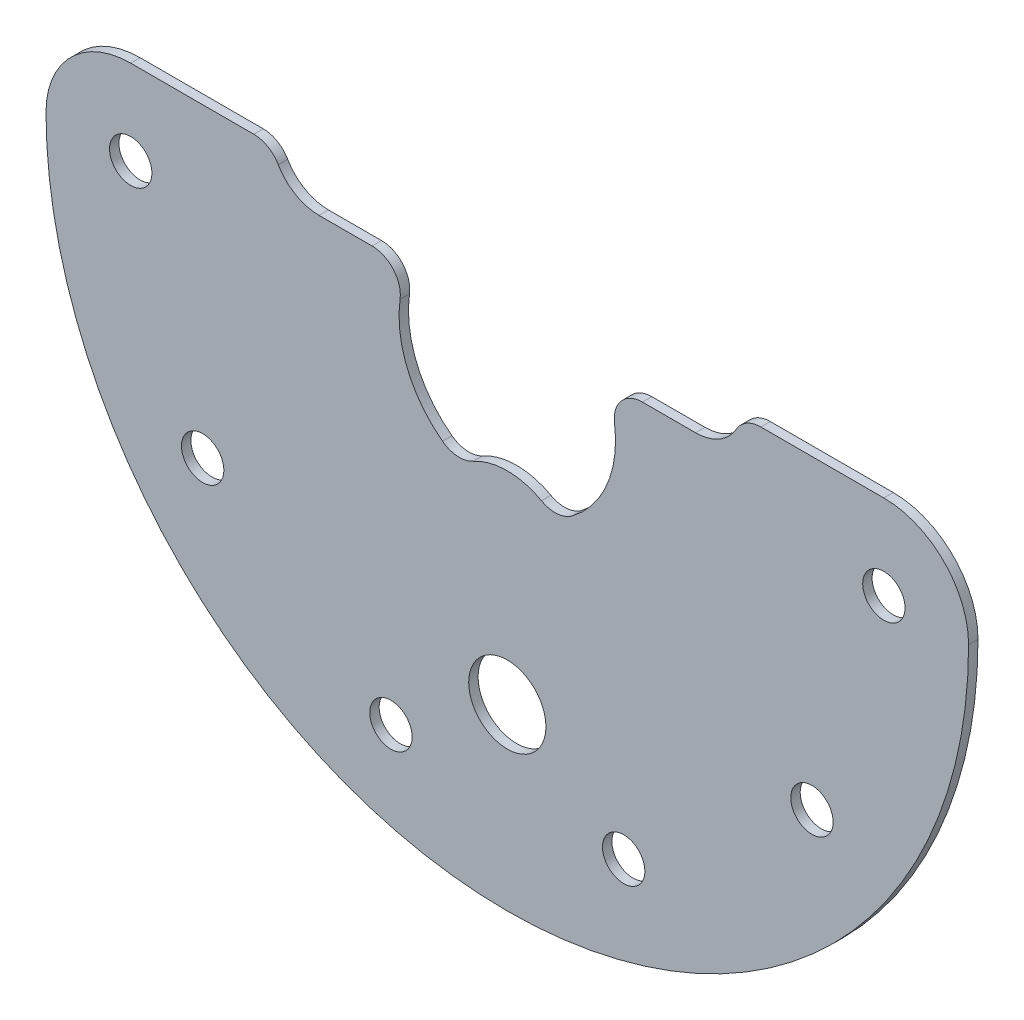
ISO-10303-21;
HEADER;
FILE_DESCRIPTION(('STEP AP214'),'2;1');
FILE_NAME('part.step','',(''),(''),'','','');
FILE_SCHEMA(('AUTOMOTIVE_DESIGN { 1 0 10303 214 1 1 1 1 }'));
ENDSEC;
DATA;
#1=APPLICATION_CONTEXT('core data for automotive mechanical design processes');
#2=APPLICATION_PROTOCOL_DEFINITION('international standard','automotive_design',2000,#1);
#3=PRODUCT_CONTEXT('',#1,'mechanical');
#4=PRODUCT('Part','Part','',(#3));
#5=PRODUCT_RELATED_PRODUCT_CATEGORY('part','',(#4));
#6=PRODUCT_DEFINITION_FORMATION('','',#4);
#7=PRODUCT_DEFINITION_CONTEXT('part definition',#1,'design');
#8=PRODUCT_DEFINITION('design','',#6,#7);
#9=PRODUCT_DEFINITION_SHAPE('','',#8);
#10=(LENGTH_UNIT() NAMED_UNIT(*) SI_UNIT(.MILLI.,.METRE.));
#11=(NAMED_UNIT(*) PLANE_ANGLE_UNIT() SI_UNIT($,.RADIAN.));
#12=(NAMED_UNIT(*) SI_UNIT($,.STERADIAN.) SOLID_ANGLE_UNIT());
#13=UNCERTAINTY_MEASURE_WITH_UNIT(LENGTH_MEASURE(1.E-05),#10,'distance_accuracy_value','');
#14=(GEOMETRIC_REPRESENTATION_CONTEXT(3) GLOBAL_UNCERTAINTY_ASSIGNED_CONTEXT((#13)) GLOBAL_UNIT_ASSIGNED_CONTEXT((#10,
#11,#12)) REPRESENTATION_CONTEXT('',''));
#15=CARTESIAN_POINT('',(0.,0.,0.));
#16=DIRECTION('',(0.,0.,1.));
#17=DIRECTION('',(1.,0.,0.));
#18=AXIS2_PLACEMENT_3D('',#15,#16,#17);
#19=CARTESIAN_POINT('',(-605.083290641897,-6.8125,0.));
#20=DIRECTION('',(0.,0.,1.));
#21=DIRECTION('',(1.,0.,0.));
#22=AXIS2_PLACEMENT_3D('',#19,#20,#21);
#23=CYLINDRICAL_SURFACE('',#22,3.);
#24=CARTESIAN_POINT('',(-605.083290641897,-6.8125,1.));
#25=DIRECTION('',(0.,0.,-1.));
#26=DIRECTION('',(-1.,0.,0.));
#27=AXIS2_PLACEMENT_3D('',#24,#25,#26);
#28=CIRCLE('',#27,3.);
#29=CARTESIAN_POINT('',(-603.630921887069,-9.43750000000003,1.));
#30=VERTEX_POINT('',#29);
#31=CARTESIAN_POINT('',(-606.87739322139,-9.21691176470596,1.));
#32=VERTEX_POINT('',#31);
#33=EDGE_CURVE('E190',#30,#32,#28,.T.);
#34=ORIENTED_EDGE('',*,*,#33,.F.);
#35=DIRECTION('',(0.,0.,1.));
#36=VECTOR('',#35,1.);
#37=CARTESIAN_POINT('',(-603.630921887069,-9.43750000000003,0.));
#38=LINE('',#37,#36);
#39=CARTESIAN_POINT('',(-603.630921887069,-9.43750000000003,0.));
#40=VERTEX_POINT('',#39);
#41=EDGE_CURVE('E11',#40,#30,#38,.T.);
#42=ORIENTED_EDGE('',*,*,#41,.F.);
#43=CARTESIAN_POINT('',(-605.083290641897,-6.8125,0.));
#44=DIRECTION('',(0.,0.,-1.));
#45=DIRECTION('',(-1.,0.,0.));
#46=AXIS2_PLACEMENT_3D('',#43,#44,#45);
#47=CIRCLE('',#46,3.);
#48=CARTESIAN_POINT('',(-606.87739322139,-9.21691176470596,0.));
#49=VERTEX_POINT('',#48);
#50=EDGE_CURVE('E241',#40,#49,#47,.T.);
#51=ORIENTED_EDGE('',*,*,#50,.T.);
#52=DIRECTION('',(0.,0.,1.));
#53=VECTOR('',#52,1.);
#54=CARTESIAN_POINT('',(-606.87739322139,-9.21691176470596,0.));
#55=LINE('',#54,#53);
#56=EDGE_CURVE('E36',#49,#32,#55,.T.);
#57=ORIENTED_EDGE('',*,*,#56,.T.);
#58=EDGE_LOOP('',(#34,#42,#51,#57));
#59=FACE_BOUND('',#58,.T.);
#60=ADVANCED_FACE('F33',(#59),#23,.F.);
#61=CARTESIAN_POINT('',(-600.,-16.,0.));
#62=DIRECTION('',(0.,0.,1.));
#63=DIRECTION('',(1.,0.,0.));
#64=AXIS2_PLACEMENT_3D('',#61,#62,#63);
#65=CYLINDRICAL_SURFACE('',#64,7.49999999999977);
#66=CARTESIAN_POINT('',(-600.,-16.,1.));
#67=DIRECTION('',(0.,0.,1.));
#68=DIRECTION('',(1.,0.,0.));
#69=AXIS2_PLACEMENT_3D('',#66,#67,#68);
#70=CIRCLE('',#69,7.49999999999977);
#71=CARTESIAN_POINT('',(-596.369078112931,-9.43749999999991,1.));
#72=VERTEX_POINT('',#71);
#73=EDGE_CURVE('E239',#72,#30,#70,.T.);
#74=ORIENTED_EDGE('',*,*,#73,.F.);
#75=DIRECTION('',(0.,0.,1.));
#76=VECTOR('',#75,1.);
#77=CARTESIAN_POINT('',(-596.369078112931,-9.43749999999991,0.));
#78=LINE('',#77,#76);
#79=CARTESIAN_POINT('',(-596.369078112931,-9.43749999999991,0.));
#80=VERTEX_POINT('',#79);
#81=EDGE_CURVE('E42',#80,#72,#78,.T.);
#82=ORIENTED_EDGE('',*,*,#81,.F.);
#83=CARTESIAN_POINT('',(-600.,-16.,0.));
#84=DIRECTION('',(0.,0.,1.));
#85=DIRECTION('',(1.,0.,0.));
#86=AXIS2_PLACEMENT_3D('',#83,#84,#85);
#87=CIRCLE('',#86,7.49999999999977);
#88=EDGE_CURVE('E180',#80,#40,#87,.T.);
#89=ORIENTED_EDGE('',*,*,#88,.T.);
#90=ORIENTED_EDGE('',*,*,#41,.T.);
#91=EDGE_LOOP('',(#74,#82,#89,#90));
#92=FACE_BOUND('',#91,.T.);
#93=ADVANCED_FACE('F273',(#92),#65,.T.);
#94=CARTESIAN_POINT('',(-594.916709358103,-6.8125,0.));
#95=DIRECTION('',(0.,0.,1.));
#96=DIRECTION('',(1.,0.,0.));
#97=AXIS2_PLACEMENT_3D('',#94,#95,#96);
#98=CYLINDRICAL_SURFACE('',#97,3.00000000000003);
#99=CARTESIAN_POINT('',(-594.916709358103,-6.8125,1.));
#100=DIRECTION('',(0.,0.,-1.));
#101=DIRECTION('',(-1.,0.,0.));
#102=AXIS2_PLACEMENT_3D('',#99,#100,#101);
#103=CIRCLE('',#102,3.00000000000003);
#104=CARTESIAN_POINT('',(-593.12260677861,-9.21691176470596,1.));
#105=VERTEX_POINT('',#104);
#106=EDGE_CURVE('E167',#105,#72,#103,.T.);
#107=ORIENTED_EDGE('',*,*,#106,.F.);
#108=DIRECTION('',(0.,0.,1.));
#109=VECTOR('',#108,1.);
#110=CARTESIAN_POINT('',(-593.12260677861,-9.21691176470596,0.));
#111=LINE('',#110,#109);
#112=CARTESIAN_POINT('',(-593.12260677861,-9.21691176470596,0.));
#113=VERTEX_POINT('',#112);
#114=EDGE_CURVE('E162',#113,#105,#111,.T.);
#115=ORIENTED_EDGE('',*,*,#114,.F.);
#116=CARTESIAN_POINT('',(-594.916709358103,-6.8125,0.));
#117=DIRECTION('',(0.,0.,-1.));
#118=DIRECTION('',(-1.,0.,0.));
#119=AXIS2_PLACEMENT_3D('',#116,#117,#118);
#120=CIRCLE('',#119,3.00000000000003);
#121=EDGE_CURVE('E165',#113,#80,#120,.T.);
#122=ORIENTED_EDGE('',*,*,#121,.T.);
#123=ORIENTED_EDGE('',*,*,#81,.T.);
#124=EDGE_LOOP('',(#107,#115,#122,#123));
#125=FACE_BOUND('',#124,.T.);
#126=ADVANCED_FACE('F164',(#125),#98,.F.);
#127=CARTESIAN_POINT('',(-600.,0.,0.));
#128=DIRECTION('',(0.,0.,1.));
#129=DIRECTION('',(1.,0.,0.));
#130=AXIS2_PLACEMENT_3D('',#127,#128,#129);
#131=CYLINDRICAL_SURFACE('',#130,11.4999999999999);
#132=CARTESIAN_POINT('',(-600.,0.,1.));
#133=DIRECTION('',(0.,0.,-1.));
#134=DIRECTION('',(-1.,0.,0.));
#135=AXIS2_PLACEMENT_3D('',#132,#133,#134);
#136=CIRCLE('',#135,11.4999999999999);
#137=CARTESIAN_POINT('',(-588.609918890485,1.58620689655174,1.));
#138=VERTEX_POINT('',#137);
#139=EDGE_CURVE('E236',#138,#105,#136,.T.);
#140=ORIENTED_EDGE('',*,*,#139,.F.);
#141=DIRECTION('',(0.,0.,1.));
#142=VECTOR('',#141,1.);
#143=CARTESIAN_POINT('',(-588.609918890485,1.58620689655174,0.));
#144=LINE('',#143,#142);
#145=CARTESIAN_POINT('',(-588.609918890485,1.58620689655174,0.));
#146=VERTEX_POINT('',#145);
#147=EDGE_CURVE('E172',#146,#138,#144,.T.);
#148=ORIENTED_EDGE('',*,*,#147,.F.);
#149=CARTESIAN_POINT('',(-600.,0.,0.));
#150=DIRECTION('',(0.,0.,-1.));
#151=DIRECTION('',(-1.,0.,0.));
#152=AXIS2_PLACEMENT_3D('',#149,#150,#151);
#153=CIRCLE('',#152,11.4999999999999);
#154=EDGE_CURVE('E178',#146,#113,#153,.T.);
#155=ORIENTED_EDGE('',*,*,#154,.T.);
#156=ORIENTED_EDGE('',*,*,#114,.T.);
#157=EDGE_LOOP('',(#140,#148,#155,#156));
#158=FACE_BOUND('',#157,.T.);
#159=ADVANCED_FACE('F182',(#158),#131,.F.);
#160=CARTESIAN_POINT('',(-585.638593383655,2.,0.));
#161=DIRECTION('',(0.,0.,1.));
#162=DIRECTION('',(1.,0.,0.));
#163=AXIS2_PLACEMENT_3D('',#160,#161,#162);
#164=CYLINDRICAL_SURFACE('',#163,2.99999999999999);
#165=CARTESIAN_POINT('',(-585.638593383655,2.,1.));
#166=DIRECTION('',(0.,0.,1.));
#167=DIRECTION('',(1.,0.,0.));
#168=AXIS2_PLACEMENT_3D('',#165,#166,#167);
#169=CIRCLE('',#168,2.99999999999999);
#170=CARTESIAN_POINT('',(-585.638593383655,5.,1.));
#171=VERTEX_POINT('',#170);
#172=EDGE_CURVE('E233',#171,#138,#169,.T.);
#173=ORIENTED_EDGE('',*,*,#172,.F.);
#174=DIRECTION('',(0.,0.,1.));
#175=VECTOR('',#174,1.);
#176=CARTESIAN_POINT('',(-585.638593383655,5.,0.));
#177=LINE('',#176,#175);
#178=CARTESIAN_POINT('',(-585.638593383655,5.,0.));
#179=VERTEX_POINT('',#178);
#180=EDGE_CURVE('E245',#179,#171,#177,.T.);
#181=ORIENTED_EDGE('',*,*,#180,.F.);
#182=CARTESIAN_POINT('',(-585.638593383655,2.,0.));
#183=DIRECTION('',(0.,0.,1.));
#184=DIRECTION('',(1.,0.,0.));
#185=AXIS2_PLACEMENT_3D('',#182,#183,#184);
#186=CIRCLE('',#185,2.99999999999999);
#187=EDGE_CURVE('E183',#179,#146,#186,.T.);
#188=ORIENTED_EDGE('',*,*,#187,.T.);
#189=ORIENTED_EDGE('',*,*,#147,.T.);
#190=EDGE_LOOP('',(#173,#181,#188,#189));
#191=FACE_BOUND('',#190,.T.);
#192=ADVANCED_FACE('F286',(#191),#164,.T.);
#193=CARTESIAN_POINT('',(-580.,5.,0.));
#194=DIRECTION('',(0.,1.,0.));
#195=DIRECTION('',(0.,0.,1.));
#196=AXIS2_PLACEMENT_3D('',#193,#194,#195);
#197=PLANE('',#196);
#198=DIRECTION('',(-1.,0.,0.));
#199=VECTOR('',#198,1.);
#200=CARTESIAN_POINT('',(-580.,5.,1.));
#201=LINE('',#200,#199);
#202=CARTESIAN_POINT('',(-580.,5.00000000000009,1.));
#203=VERTEX_POINT('',#202);
#204=EDGE_CURVE('E230',#203,#171,#201,.T.);
#205=ORIENTED_EDGE('',*,*,#204,.F.);
#206=DIRECTION('',(0.,0.,1.));
#207=VECTOR('',#206,1.);
#208=CARTESIAN_POINT('',(-580.,5.00000000000009,0.));
#209=LINE('',#208,#207);
#210=CARTESIAN_POINT('',(-580.,5.00000000000009,0.));
#211=VERTEX_POINT('',#210);
#212=EDGE_CURVE('E247',#211,#203,#209,.T.);
#213=ORIENTED_EDGE('',*,*,#212,.F.);
#214=DIRECTION('',(-1.,0.,0.));
#215=VECTOR('',#214,1.);
#216=CARTESIAN_POINT('',(-580.,5.,0.));
#217=LINE('',#216,#215);
#218=EDGE_CURVE('E185',#211,#179,#217,.T.);
#219=ORIENTED_EDGE('',*,*,#218,.T.);
#220=ORIENTED_EDGE('',*,*,#180,.T.);
#221=EDGE_LOOP('',(#205,#213,#219,#220));
#222=FACE_BOUND('',#221,.T.);
#223=ADVANCED_FACE('F289',(#222),#197,.T.);
#224=CARTESIAN_POINT('',(-580.,10.,0.));
#225=DIRECTION('',(0.,0.,1.));
#226=DIRECTION('',(1.,0.,0.));
#227=AXIS2_PLACEMENT_3D('',#224,#225,#226);
#228=CYLINDRICAL_SURFACE('',#227,4.99999999999991);
#229=CARTESIAN_POINT('',(-580.,10.,1.));
#230=DIRECTION('',(0.,0.,-1.));
#231=DIRECTION('',(-1.,0.,0.));
#232=AXIS2_PLACEMENT_3D('',#229,#230,#231);
#233=CIRCLE('',#232,4.99999999999991);
#234=CARTESIAN_POINT('',(-575.669872981078,7.49999999999984,1.));
#235=VERTEX_POINT('',#234);
#236=EDGE_CURVE('E227',#235,#203,#233,.T.);
#237=ORIENTED_EDGE('',*,*,#236,.F.);
#238=DIRECTION('',(0.,0.,1.));
#239=VECTOR('',#238,1.);
#240=CARTESIAN_POINT('',(-575.669872981078,7.49999999999984,0.));
#241=LINE('',#240,#239);
#242=CARTESIAN_POINT('',(-575.669872981078,7.49999999999984,0.));
#243=VERTEX_POINT('',#242);
#244=EDGE_CURVE('E249',#243,#235,#241,.T.);
#245=ORIENTED_EDGE('',*,*,#244,.F.);
#246=CARTESIAN_POINT('',(-580.,10.,0.));
#247=DIRECTION('',(0.,0.,-1.));
#248=DIRECTION('',(-1.,0.,0.));
#249=AXIS2_PLACEMENT_3D('',#246,#247,#248);
#250=CIRCLE('',#249,4.99999999999991);
#251=EDGE_CURVE('E455',#243,#211,#250,.T.);
#252=ORIENTED_EDGE('',*,*,#251,.T.);
#253=ORIENTED_EDGE('',*,*,#212,.T.);
#254=EDGE_LOOP('',(#237,#245,#252,#253));
#255=FACE_BOUND('',#254,.T.);
#256=ADVANCED_FACE('F293',(#255),#228,.F.);
#257=CARTESIAN_POINT('',(-573.071796769724,6.,0.));
#258=DIRECTION('',(0.,0.,1.));
#259=DIRECTION('',(1.,0.,0.));
#260=AXIS2_PLACEMENT_3D('',#257,#258,#259);
#261=CYLINDRICAL_SURFACE('',#260,3.00000000000029);
#262=CARTESIAN_POINT('',(-573.071796769724,6.,1.));
#263=DIRECTION('',(0.,0.,1.));
#264=DIRECTION('',(1.,0.,0.));
#265=AXIS2_PLACEMENT_3D('',#262,#263,#264);
#266=CIRCLE('',#265,3.00000000000029);
#267=CARTESIAN_POINT('',(-573.071796769724,9.,1.));
#268=VERTEX_POINT('',#267);
#269=EDGE_CURVE('E224',#268,#235,#266,.T.);
#270=ORIENTED_EDGE('',*,*,#269,.F.);
#271=DIRECTION('',(0.,0.,1.));
#272=VECTOR('',#271,1.);
#273=CARTESIAN_POINT('',(-573.071796769724,9.,0.));
#274=LINE('',#273,#272);
#275=CARTESIAN_POINT('',(-573.071796769724,9.,0.));
#276=VERTEX_POINT('',#275);
#277=EDGE_CURVE('E251',#276,#268,#274,.T.);
#278=ORIENTED_EDGE('',*,*,#277,.F.);
#279=CARTESIAN_POINT('',(-573.071796769724,6.,0.));
#280=DIRECTION('',(0.,0.,1.));
#281=DIRECTION('',(1.,0.,0.));
#282=AXIS2_PLACEMENT_3D('',#279,#280,#281);
#283=CIRCLE('',#282,3.00000000000029);
#284=EDGE_CURVE('E452',#276,#243,#283,.T.);
#285=ORIENTED_EDGE('',*,*,#284,.T.);
#286=ORIENTED_EDGE('',*,*,#244,.T.);
#287=EDGE_LOOP('',(#270,#278,#285,#286));
#288=FACE_BOUND('',#287,.T.);
#289=ADVANCED_FACE('F297',(#288),#261,.T.);
#290=CARTESIAN_POINT('',(-560.,9.,0.));
#291=DIRECTION('',(0.,1.,0.));
#292=DIRECTION('',(0.,0.,1.));
#293=AXIS2_PLACEMENT_3D('',#290,#291,#292);
#294=PLANE('',#293);
#295=DIRECTION('',(-1.,0.,0.));
#296=VECTOR('',#295,1.);
#297=CARTESIAN_POINT('',(-560.,9.,1.));
#298=LINE('',#297,#296);
#299=CARTESIAN_POINT('',(-560.,9.00000000000001,1.));
#300=VERTEX_POINT('',#299);
#301=EDGE_CURVE('E221',#300,#268,#298,.T.);
#302=ORIENTED_EDGE('',*,*,#301,.F.);
#303=DIRECTION('',(0.,0.,1.));
#304=VECTOR('',#303,1.);
#305=CARTESIAN_POINT('',(-560.,9.00000000000001,0.));
#306=LINE('',#305,#304);
#307=CARTESIAN_POINT('',(-560.,9.00000000000001,0.));
#308=VERTEX_POINT('',#307);
#309=EDGE_CURVE('E253',#308,#300,#306,.T.);
#310=ORIENTED_EDGE('',*,*,#309,.F.);
#311=DIRECTION('',(-1.,0.,0.));
#312=VECTOR('',#311,1.);
#313=CARTESIAN_POINT('',(-560.,9.,0.));
#314=LINE('',#313,#312);
#315=EDGE_CURVE('E449',#308,#276,#314,.T.);
#316=ORIENTED_EDGE('',*,*,#315,.T.);
#317=ORIENTED_EDGE('',*,*,#277,.T.);
#318=EDGE_LOOP('',(#302,#310,#316,#317));
#319=FACE_BOUND('',#318,.T.);
#320=ADVANCED_FACE('F301',(#319),#294,.T.);
#321=CARTESIAN_POINT('',(-560.,0.,0.));
#322=DIRECTION('',(0.,0.,1.));
#323=DIRECTION('',(1.,0.,0.));
#324=AXIS2_PLACEMENT_3D('',#321,#322,#323);
#325=CYLINDRICAL_SURFACE('',#324,9.00000000000001);
#326=CARTESIAN_POINT('',(-560.,0.,1.));
#327=DIRECTION('',(0.,0.,1.));
#328=DIRECTION('',(1.,0.,0.));
#329=AXIS2_PLACEMENT_3D('',#326,#327,#328);
#330=CIRCLE('',#329,9.00000000000001);
#331=CARTESIAN_POINT('',(-551.,0.,1.));
#332=VERTEX_POINT('',#331);
#333=EDGE_CURVE('E218',#332,#300,#330,.T.);
#334=ORIENTED_EDGE('',*,*,#333,.F.);
#335=DIRECTION('',(0.,0.,1.));
#336=VECTOR('',#335,1.);
#337=CARTESIAN_POINT('',(-551.,0.,0.));
#338=LINE('',#337,#336);
#339=CARTESIAN_POINT('',(-551.,0.,0.));
#340=VERTEX_POINT('',#339);
#341=EDGE_CURVE('E255',#340,#332,#338,.T.);
#342=ORIENTED_EDGE('',*,*,#341,.F.);
#343=CARTESIAN_POINT('',(-560.,0.,0.));
#344=DIRECTION('',(0.,0.,1.));
#345=DIRECTION('',(1.,0.,0.));
#346=AXIS2_PLACEMENT_3D('',#343,#344,#345);
#347=CIRCLE('',#346,9.00000000000001);
#348=EDGE_CURVE('E446',#340,#308,#347,.T.);
#349=ORIENTED_EDGE('',*,*,#348,.T.);
#350=ORIENTED_EDGE('',*,*,#309,.T.);
#351=EDGE_LOOP('',(#334,#342,#349,#350));
#352=FACE_BOUND('',#351,.T.);
#353=ADVANCED_FACE('F305',(#352),#325,.T.);
#354=CARTESIAN_POINT('',(-600.,0.,0.));
#355=DIRECTION('',(0.,0.,1.));
#356=DIRECTION('',(1.,0.,0.));
#357=AXIS2_PLACEMENT_3D('',#354,#355,#356);
#358=CYLINDRICAL_SURFACE('',#357,49.);
#359=CARTESIAN_POINT('',(-600.,0.,1.));
#360=DIRECTION('',(0.,0.,1.));
#361=DIRECTION('',(1.,0.,0.));
#362=AXIS2_PLACEMENT_3D('',#359,#360,#361);
#363=CIRCLE('',#362,49.);
#364=CARTESIAN_POINT('',(-649.,0.,1.));
#365=VERTEX_POINT('',#364);
#366=EDGE_CURVE('E215',#365,#332,#363,.T.);
#367=ORIENTED_EDGE('',*,*,#366,.F.);
#368=DIRECTION('',(0.,0.,1.));
#369=VECTOR('',#368,1.);
#370=CARTESIAN_POINT('',(-649.,0.,0.));
#371=LINE('',#370,#369);
#372=CARTESIAN_POINT('',(-649.,0.,0.));
#373=VERTEX_POINT('',#372);
#374=EDGE_CURVE('E257',#373,#365,#371,.T.);
#375=ORIENTED_EDGE('',*,*,#374,.F.);
#376=CARTESIAN_POINT('',(-600.,0.,0.));
#377=DIRECTION('',(0.,0.,1.));
#378=DIRECTION('',(1.,0.,0.));
#379=AXIS2_PLACEMENT_3D('',#376,#377,#378);
#380=CIRCLE('',#379,49.);
#381=EDGE_CURVE('E443',#373,#340,#380,.T.);
#382=ORIENTED_EDGE('',*,*,#381,.T.);
#383=ORIENTED_EDGE('',*,*,#341,.T.);
#384=EDGE_LOOP('',(#367,#375,#382,#383));
#385=FACE_BOUND('',#384,.T.);
#386=ADVANCED_FACE('F309',(#385),#358,.T.);
#387=CARTESIAN_POINT('',(-640.,0.,0.));
#388=DIRECTION('',(0.,0.,1.));
#389=DIRECTION('',(1.,0.,0.));
#390=AXIS2_PLACEMENT_3D('',#387,#388,#389);
#391=CYLINDRICAL_SURFACE('',#390,9.00000000000001);
#392=CARTESIAN_POINT('',(-640.,0.,1.));
#393=DIRECTION('',(0.,0.,1.));
#394=DIRECTION('',(1.,0.,0.));
#395=AXIS2_PLACEMENT_3D('',#392,#393,#394);
#396=CIRCLE('',#395,9.00000000000001);
#397=CARTESIAN_POINT('',(-640.,9.,1.));
#398=VERTEX_POINT('',#397);
#399=EDGE_CURVE('E212',#398,#365,#396,.T.);
#400=ORIENTED_EDGE('',*,*,#399,.F.);
#401=DIRECTION('',(0.,0.,1.));
#402=VECTOR('',#401,1.);
#403=CARTESIAN_POINT('',(-640.,9.,0.));
#404=LINE('',#403,#402);
#405=CARTESIAN_POINT('',(-640.,9.,0.));
#406=VERTEX_POINT('',#405);
#407=EDGE_CURVE('E259',#406,#398,#404,.T.);
#408=ORIENTED_EDGE('',*,*,#407,.F.);
#409=CARTESIAN_POINT('',(-640.,0.,0.));
#410=DIRECTION('',(0.,0.,1.));
#411=DIRECTION('',(1.,0.,0.));
#412=AXIS2_PLACEMENT_3D('',#409,#410,#411);
#413=CIRCLE('',#412,9.00000000000001);
#414=EDGE_CURVE('E440',#406,#373,#413,.T.);
#415=ORIENTED_EDGE('',*,*,#414,.T.);
#416=ORIENTED_EDGE('',*,*,#374,.T.);
#417=EDGE_LOOP('',(#400,#408,#415,#416));
#418=FACE_BOUND('',#417,.T.);
#419=ADVANCED_FACE('F313',(#418),#391,.T.);
#420=CARTESIAN_POINT('',(-626.928203230276,9.,0.));
#421=DIRECTION('',(0.,1.,0.));
#422=DIRECTION('',(0.,0.,1.));
#423=AXIS2_PLACEMENT_3D('',#420,#421,#422);
#424=PLANE('',#423);
#425=DIRECTION('',(-1.,0.,0.));
#426=VECTOR('',#425,1.);
#427=CARTESIAN_POINT('',(-626.928203230276,9.,1.));
#428=LINE('',#427,#426);
#429=CARTESIAN_POINT('',(-626.928203230276,9.00000000000029,1.));
#430=VERTEX_POINT('',#429);
#431=EDGE_CURVE('E209',#430,#398,#428,.T.);
#432=ORIENTED_EDGE('',*,*,#431,.F.);
#433=DIRECTION('',(0.,0.,1.));
#434=VECTOR('',#433,1.);
#435=CARTESIAN_POINT('',(-626.928203230276,9.00000000000029,0.));
#436=LINE('',#435,#434);
#437=CARTESIAN_POINT('',(-626.928203230276,9.00000000000029,0.));
#438=VERTEX_POINT('',#437);
#439=EDGE_CURVE('E261',#438,#430,#436,.T.);
#440=ORIENTED_EDGE('',*,*,#439,.F.);
#441=DIRECTION('',(-1.,0.,0.));
#442=VECTOR('',#441,1.);
#443=CARTESIAN_POINT('',(-626.928203230276,9.,0.));
#444=LINE('',#443,#442);
#445=EDGE_CURVE('E437',#438,#406,#444,.T.);
#446=ORIENTED_EDGE('',*,*,#445,.T.);
#447=ORIENTED_EDGE('',*,*,#407,.T.);
#448=EDGE_LOOP('',(#432,#440,#446,#447));
#449=FACE_BOUND('',#448,.T.);
#450=ADVANCED_FACE('F317',(#449),#424,.T.);
#451=CARTESIAN_POINT('',(-626.928203230276,6.,0.));
#452=DIRECTION('',(0.,0.,1.));
#453=DIRECTION('',(1.,0.,0.));
#454=AXIS2_PLACEMENT_3D('',#451,#452,#453);
#455=CYLINDRICAL_SURFACE('',#454,3.00000000000029);
#456=CARTESIAN_POINT('',(-626.928203230276,6.,1.));
#457=DIRECTION('',(0.,0.,1.));
#458=DIRECTION('',(1.,0.,0.));
#459=AXIS2_PLACEMENT_3D('',#456,#457,#458);
#460=CIRCLE('',#459,3.00000000000029);
#461=CARTESIAN_POINT('',(-624.330127018922,7.49999999999997,1.));
#462=VERTEX_POINT('',#461);
#463=EDGE_CURVE('E206',#462,#430,#460,.T.);
#464=ORIENTED_EDGE('',*,*,#463,.F.);
#465=DIRECTION('',(0.,0.,1.));
#466=VECTOR('',#465,1.);
#467=CARTESIAN_POINT('',(-624.330127018922,7.49999999999997,0.));
#468=LINE('',#467,#466);
#469=CARTESIAN_POINT('',(-624.330127018922,7.49999999999997,0.));
#470=VERTEX_POINT('',#469);
#471=EDGE_CURVE('E263',#470,#462,#468,.T.);
#472=ORIENTED_EDGE('',*,*,#471,.F.);
#473=CARTESIAN_POINT('',(-626.928203230276,6.,0.));
#474=DIRECTION('',(0.,0.,1.));
#475=DIRECTION('',(1.,0.,0.));
#476=AXIS2_PLACEMENT_3D('',#473,#474,#475);
#477=CIRCLE('',#476,3.00000000000029);
#478=EDGE_CURVE('E434',#470,#438,#477,.T.);
#479=ORIENTED_EDGE('',*,*,#478,.T.);
#480=ORIENTED_EDGE('',*,*,#439,.T.);
#481=EDGE_LOOP('',(#464,#472,#479,#480));
#482=FACE_BOUND('',#481,.T.);
#483=ADVANCED_FACE('F321',(#482),#455,.T.);
#484=CARTESIAN_POINT('',(-620.,10.,0.));
#485=DIRECTION('',(0.,0.,1.));
#486=DIRECTION('',(1.,0.,0.));
#487=AXIS2_PLACEMENT_3D('',#484,#485,#486);
#488=CYLINDRICAL_SURFACE('',#487,4.99999999999991);
#489=CARTESIAN_POINT('',(-620.,10.,1.));
#490=DIRECTION('',(0.,0.,-1.));
#491=DIRECTION('',(-1.,0.,0.));
#492=AXIS2_PLACEMENT_3D('',#489,#490,#491);
#493=CIRCLE('',#492,4.99999999999991);
#494=CARTESIAN_POINT('',(-620.,5.,1.));
#495=VERTEX_POINT('',#494);
#496=EDGE_CURVE('E203',#495,#462,#493,.T.);
#497=ORIENTED_EDGE('',*,*,#496,.F.);
#498=DIRECTION('',(0.,0.,1.));
#499=VECTOR('',#498,1.);
#500=CARTESIAN_POINT('',(-620.,5.,0.));
#501=LINE('',#500,#499);
#502=CARTESIAN_POINT('',(-620.,5.,0.));
#503=VERTEX_POINT('',#502);
#504=EDGE_CURVE('E265',#503,#495,#501,.T.);
#505=ORIENTED_EDGE('',*,*,#504,.F.);
#506=CARTESIAN_POINT('',(-620.,10.,0.));
#507=DIRECTION('',(0.,0.,-1.));
#508=DIRECTION('',(-1.,0.,0.));
#509=AXIS2_PLACEMENT_3D('',#506,#507,#508);
#510=CIRCLE('',#509,4.99999999999991);
#511=EDGE_CURVE('E431',#503,#470,#510,.T.);
#512=ORIENTED_EDGE('',*,*,#511,.T.);
#513=ORIENTED_EDGE('',*,*,#471,.T.);
#514=EDGE_LOOP('',(#497,#505,#512,#513));
#515=FACE_BOUND('',#514,.T.);
#516=ADVANCED_FACE('F325',(#515),#488,.F.);
#517=CARTESIAN_POINT('',(-614.361406616345,5.,0.));
#518=DIRECTION('',(0.,1.,0.));
#519=DIRECTION('',(0.,0.,1.));
#520=AXIS2_PLACEMENT_3D('',#517,#518,#519);
#521=PLANE('',#520);
#522=DIRECTION('',(-1.,0.,0.));
#523=VECTOR('',#522,1.);
#524=CARTESIAN_POINT('',(-614.361406616345,5.,1.));
#525=LINE('',#524,#523);
#526=CARTESIAN_POINT('',(-614.361406616345,4.99999999999999,1.));
#527=VERTEX_POINT('',#526);
#528=EDGE_CURVE('E200',#527,#495,#525,.T.);
#529=ORIENTED_EDGE('',*,*,#528,.F.);
#530=DIRECTION('',(0.,0.,1.));
#531=VECTOR('',#530,1.);
#532=CARTESIAN_POINT('',(-614.361406616345,4.99999999999999,0.));
#533=LINE('',#532,#531);
#534=CARTESIAN_POINT('',(-614.361406616345,4.99999999999999,0.));
#535=VERTEX_POINT('',#534);
#536=EDGE_CURVE('E267',#535,#527,#533,.T.);
#537=ORIENTED_EDGE('',*,*,#536,.F.);
#538=DIRECTION('',(-1.,0.,0.));
#539=VECTOR('',#538,1.);
#540=CARTESIAN_POINT('',(-614.361406616345,5.,0.));
#541=LINE('',#540,#539);
#542=EDGE_CURVE('E428',#535,#503,#541,.T.);
#543=ORIENTED_EDGE('',*,*,#542,.T.);
#544=ORIENTED_EDGE('',*,*,#504,.T.);
#545=EDGE_LOOP('',(#529,#537,#543,#544));
#546=FACE_BOUND('',#545,.T.);
#547=ADVANCED_FACE('F329',(#546),#521,.T.);
#548=CARTESIAN_POINT('',(-614.361406616345,2.,0.));
#549=DIRECTION('',(0.,0.,1.));
#550=DIRECTION('',(1.,0.,0.));
#551=AXIS2_PLACEMENT_3D('',#548,#549,#550);
#552=CYLINDRICAL_SURFACE('',#551,2.99999999999999);
#553=CARTESIAN_POINT('',(-614.361406616345,2.,1.));
#554=DIRECTION('',(0.,0.,1.));
#555=DIRECTION('',(1.,0.,0.));
#556=AXIS2_PLACEMENT_3D('',#553,#554,#555);
#557=CIRCLE('',#556,2.99999999999999);
#558=CARTESIAN_POINT('',(-611.390081109515,1.58620689655173,1.));
#559=VERTEX_POINT('',#558);
#560=EDGE_CURVE('E197',#559,#527,#557,.T.);
#561=ORIENTED_EDGE('',*,*,#560,.F.);
#562=DIRECTION('',(0.,0.,1.));
#563=VECTOR('',#562,1.);
#564=CARTESIAN_POINT('',(-611.390081109515,1.58620689655173,0.));
#565=LINE('',#564,#563);
#566=CARTESIAN_POINT('',(-611.390081109515,1.58620689655173,0.));
#567=VERTEX_POINT('',#566);
#568=EDGE_CURVE('E268',#567,#559,#565,.T.);
#569=ORIENTED_EDGE('',*,*,#568,.F.);
#570=CARTESIAN_POINT('',(-614.361406616345,2.,0.));
#571=DIRECTION('',(0.,0.,1.));
#572=DIRECTION('',(1.,0.,0.));
#573=AXIS2_PLACEMENT_3D('',#570,#571,#572);
#574=CIRCLE('',#573,2.99999999999999);
#575=EDGE_CURVE('E425',#567,#535,#574,.T.);
#576=ORIENTED_EDGE('',*,*,#575,.T.);
#577=ORIENTED_EDGE('',*,*,#536,.T.);
#578=EDGE_LOOP('',(#561,#569,#576,#577));
#579=FACE_BOUND('',#578,.T.);
#580=ADVANCED_FACE('F333',(#579),#552,.T.);
#581=CARTESIAN_POINT('',(-600.,0.,0.));
#582=DIRECTION('',(0.,0.,1.));
#583=DIRECTION('',(1.,0.,0.));
#584=AXIS2_PLACEMENT_3D('',#581,#582,#583);
#585=CYLINDRICAL_SURFACE('',#584,11.4999999999999);
#586=CARTESIAN_POINT('',(-600.,0.,1.));
#587=DIRECTION('',(0.,0.,-1.));
#588=DIRECTION('',(-1.,0.,0.));
#589=AXIS2_PLACEMENT_3D('',#586,#587,#588);
#590=CIRCLE('',#589,11.4999999999999);
#591=EDGE_CURVE('E193',#32,#559,#590,.T.);
#592=ORIENTED_EDGE('',*,*,#591,.F.);
#593=ORIENTED_EDGE('',*,*,#56,.F.);
#594=CARTESIAN_POINT('',(-600.,0.,0.));
#595=DIRECTION('',(0.,0.,-1.));
#596=DIRECTION('',(-1.,0.,0.));
#597=AXIS2_PLACEMENT_3D('',#594,#595,#596);
#598=CIRCLE('',#597,11.4999999999999);
#599=EDGE_CURVE('E423',#49,#567,#598,.T.);
#600=ORIENTED_EDGE('',*,*,#599,.T.);
#601=ORIENTED_EDGE('',*,*,#568,.T.);
#602=EDGE_LOOP('',(#592,#593,#600,#601));
#603=FACE_BOUND('',#602,.T.);
#604=ADVANCED_FACE('F270',(#603),#585,.F.);
#605=CARTESIAN_POINT('',(-605.083290641897,-6.8125,0.));
#606=DIRECTION('',(0.,0.,-1.));
#607=DIRECTION('',(-1.,0.,0.));
#608=AXIS2_PLACEMENT_3D('',#605,#606,#607);
#609=PLANE('',#608);
#610=CARTESIAN_POINT('',(-560.,0.,0.));
#611=DIRECTION('',(0.,0.,1.));
#612=DIRECTION('',(-1.,0.,0.));
#613=AXIS2_PLACEMENT_3D('',#610,#611,#612);
#614=CIRCLE('',#613,2.24999999999997);
#615=CARTESIAN_POINT('',(-562.25,0.,0.));
#616=VERTEX_POINT('',#615);
#617=EDGE_CURVE('E380',#616,#616,#614,.T.);
#618=ORIENTED_EDGE('',*,*,#617,.T.);
#619=EDGE_LOOP('',(#618));
#620=FACE_BOUND('',#619,.T.);
#621=CARTESIAN_POINT('',(-632.360679774998,-23.511410091699,0.));
#622=DIRECTION('',(0.,0.,1.));
#623=DIRECTION('',(-1.,0.,0.));
#624=AXIS2_PLACEMENT_3D('',#621,#622,#623);
#625=CIRCLE('',#624,2.24999999999997);
#626=CARTESIAN_POINT('',(-634.610679774998,-23.511410091699,0.));
#627=VERTEX_POINT('',#626);
#628=EDGE_CURVE('E388',#627,#627,#625,.T.);
#629=ORIENTED_EDGE('',*,*,#628,.T.);
#630=EDGE_LOOP('',(#629));
#631=FACE_BOUND('',#630,.T.);
#632=CARTESIAN_POINT('',(-612.360679774998,-38.0422606518063,0.));
#633=DIRECTION('',(0.,0.,1.));
#634=DIRECTION('',(-1.,0.,0.));
#635=AXIS2_PLACEMENT_3D('',#632,#633,#634);
#636=CIRCLE('',#635,2.25000000000001);
#637=CARTESIAN_POINT('',(-614.610679774998,-38.0422606518063,0.));
#638=VERTEX_POINT('',#637);
#639=EDGE_CURVE('E394',#638,#638,#636,.T.);
#640=ORIENTED_EDGE('',*,*,#639,.T.);
#641=EDGE_LOOP('',(#640));
#642=FACE_BOUND('',#641,.T.);
#643=CARTESIAN_POINT('',(-587.639320225002,-38.0422606518062,0.));
#644=DIRECTION('',(0.,0.,1.));
#645=DIRECTION('',(-1.,0.,0.));
#646=AXIS2_PLACEMENT_3D('',#643,#644,#645);
#647=CIRCLE('',#646,2.25000000000001);
#648=CARTESIAN_POINT('',(-589.889320225002,-38.0422606518062,0.));
#649=VERTEX_POINT('',#648);
#650=EDGE_CURVE('E400',#649,#649,#647,.T.);
#651=ORIENTED_EDGE('',*,*,#650,.T.);
#652=EDGE_LOOP('',(#651));
#653=FACE_BOUND('',#652,.T.);
#654=CARTESIAN_POINT('',(-567.639320225002,-23.511410091699,0.));
#655=DIRECTION('',(0.,0.,1.));
#656=DIRECTION('',(-1.,0.,0.));
#657=AXIS2_PLACEMENT_3D('',#654,#655,#656);
#658=CIRCLE('',#657,2.24999999999997);
#659=CARTESIAN_POINT('',(-569.889320225002,-23.511410091699,0.));
#660=VERTEX_POINT('',#659);
#661=EDGE_CURVE('E406',#660,#660,#658,.T.);
#662=ORIENTED_EDGE('',*,*,#661,.T.);
#663=EDGE_LOOP('',(#662));
#664=FACE_BOUND('',#663,.T.);
#665=CARTESIAN_POINT('',(-600.,-30.,0.));
#666=DIRECTION('',(0.,0.,1.));
#667=DIRECTION('',(-1.,0.,0.));
#668=AXIS2_PLACEMENT_3D('',#665,#666,#667);
#669=CIRCLE('',#668,4.09999999999999);
#670=CARTESIAN_POINT('',(-604.1,-30.,0.));
#671=VERTEX_POINT('',#670);
#672=EDGE_CURVE('E412',#671,#671,#669,.T.);
#673=ORIENTED_EDGE('',*,*,#672,.T.);
#674=EDGE_LOOP('',(#673));
#675=FACE_BOUND('',#674,.T.);
#676=CARTESIAN_POINT('',(-640.,0.,0.));
#677=DIRECTION('',(0.,0.,1.));
#678=DIRECTION('',(-1.,0.,0.));
#679=AXIS2_PLACEMENT_3D('',#676,#677,#678);
#680=CIRCLE('',#679,2.24999999999997);
#681=CARTESIAN_POINT('',(-642.25,0.,0.));
#682=VERTEX_POINT('',#681);
#683=EDGE_CURVE('E194',#682,#682,#680,.T.);
#684=ORIENTED_EDGE('',*,*,#683,.T.);
#685=EDGE_LOOP('',(#684));
#686=FACE_BOUND('',#685,.T.);
#687=ORIENTED_EDGE('',*,*,#50,.F.);
#688=ORIENTED_EDGE('',*,*,#88,.F.);
#689=ORIENTED_EDGE('',*,*,#121,.F.);
#690=ORIENTED_EDGE('',*,*,#154,.F.);
#691=ORIENTED_EDGE('',*,*,#187,.F.);
#692=ORIENTED_EDGE('',*,*,#218,.F.);
#693=ORIENTED_EDGE('',*,*,#251,.F.);
#694=ORIENTED_EDGE('',*,*,#284,.F.);
#695=ORIENTED_EDGE('',*,*,#315,.F.);
#696=ORIENTED_EDGE('',*,*,#348,.F.);
#697=ORIENTED_EDGE('',*,*,#381,.F.);
#698=ORIENTED_EDGE('',*,*,#414,.F.);
#699=ORIENTED_EDGE('',*,*,#445,.F.);
#700=ORIENTED_EDGE('',*,*,#478,.F.);
#701=ORIENTED_EDGE('',*,*,#511,.F.);
#702=ORIENTED_EDGE('',*,*,#542,.F.);
#703=ORIENTED_EDGE('',*,*,#575,.F.);
#704=ORIENTED_EDGE('',*,*,#599,.F.);
#705=EDGE_LOOP('',(#687,#688,#689,#690,#691,#692,#693,#694,#695,#696,#697,#698,#699,#700,#701,
#702,#703,#704));
#706=FACE_BOUND('',#705,.T.);
#707=ADVANCED_FACE('F176',(#620,#631,#642,#653,#664,#675,#686,#706),#609,.T.);
#708=CARTESIAN_POINT('',(-605.083290641897,-6.8125,1.));
#709=DIRECTION('',(0.,0.,-1.));
#710=DIRECTION('',(-1.,0.,0.));
#711=AXIS2_PLACEMENT_3D('',#708,#709,#710);
#712=PLANE('',#711);
#713=CARTESIAN_POINT('',(-560.,0.,1.));
#714=DIRECTION('',(0.,0.,1.));
#715=DIRECTION('',(-1.,0.,0.));
#716=AXIS2_PLACEMENT_3D('',#713,#714,#715);
#717=CIRCLE('',#716,2.24999999999997);
#718=CARTESIAN_POINT('',(-562.25,0.,1.));
#719=VERTEX_POINT('',#718);
#720=EDGE_CURVE('E383',#719,#719,#717,.T.);
#721=ORIENTED_EDGE('',*,*,#720,.F.);
#722=EDGE_LOOP('',(#721));
#723=FACE_BOUND('',#722,.T.);
#724=CARTESIAN_POINT('',(-632.360679774998,-23.511410091699,1.));
#725=DIRECTION('',(0.,0.,1.));
#726=DIRECTION('',(-1.,0.,0.));
#727=AXIS2_PLACEMENT_3D('',#724,#725,#726);
#728=CIRCLE('',#727,2.24999999999997);
#729=CARTESIAN_POINT('',(-634.610679774998,-23.511410091699,1.));
#730=VERTEX_POINT('',#729);
#731=EDGE_CURVE('E385',#730,#730,#728,.T.);
#732=ORIENTED_EDGE('',*,*,#731,.F.);
#733=EDGE_LOOP('',(#732));
#734=FACE_BOUND('',#733,.T.);
#735=CARTESIAN_POINT('',(-612.360679774998,-38.0422606518063,1.));
#736=DIRECTION('',(0.,0.,1.));
#737=DIRECTION('',(-1.,0.,0.));
#738=AXIS2_PLACEMENT_3D('',#735,#736,#737);
#739=CIRCLE('',#738,2.25000000000001);
#740=CARTESIAN_POINT('',(-614.610679774998,-38.0422606518063,1.));
#741=VERTEX_POINT('',#740);
#742=EDGE_CURVE('E391',#741,#741,#739,.T.);
#743=ORIENTED_EDGE('',*,*,#742,.F.);
#744=EDGE_LOOP('',(#743));
#745=FACE_BOUND('',#744,.T.);
#746=CARTESIAN_POINT('',(-587.639320225002,-38.0422606518062,1.));
#747=DIRECTION('',(0.,0.,1.));
#748=DIRECTION('',(-1.,0.,0.));
#749=AXIS2_PLACEMENT_3D('',#746,#747,#748);
#750=CIRCLE('',#749,2.25000000000001);
#751=CARTESIAN_POINT('',(-589.889320225002,-38.0422606518062,1.));
#752=VERTEX_POINT('',#751);
#753=EDGE_CURVE('E397',#752,#752,#750,.T.);
#754=ORIENTED_EDGE('',*,*,#753,.F.);
#755=EDGE_LOOP('',(#754));
#756=FACE_BOUND('',#755,.T.);
#757=CARTESIAN_POINT('',(-567.639320225002,-23.511410091699,1.));
#758=DIRECTION('',(0.,0.,1.));
#759=DIRECTION('',(-1.,0.,0.));
#760=AXIS2_PLACEMENT_3D('',#757,#758,#759);
#761=CIRCLE('',#760,2.24999999999997);
#762=CARTESIAN_POINT('',(-569.889320225002,-23.511410091699,1.));
#763=VERTEX_POINT('',#762);
#764=EDGE_CURVE('E403',#763,#763,#761,.T.);
#765=ORIENTED_EDGE('',*,*,#764,.F.);
#766=EDGE_LOOP('',(#765));
#767=FACE_BOUND('',#766,.T.);
#768=CARTESIAN_POINT('',(-600.,-30.,1.));
#769=DIRECTION('',(0.,0.,1.));
#770=DIRECTION('',(-1.,0.,0.));
#771=AXIS2_PLACEMENT_3D('',#768,#769,#770);
#772=CIRCLE('',#771,4.09999999999999);
#773=CARTESIAN_POINT('',(-604.1,-30.,1.));
#774=VERTEX_POINT('',#773);
#775=EDGE_CURVE('E409',#774,#774,#772,.T.);
#776=ORIENTED_EDGE('',*,*,#775,.F.);
#777=EDGE_LOOP('',(#776));
#778=FACE_BOUND('',#777,.T.);
#779=CARTESIAN_POINT('',(-640.,0.,1.));
#780=DIRECTION('',(0.,0.,1.));
#781=DIRECTION('',(-1.,0.,0.));
#782=AXIS2_PLACEMENT_3D('',#779,#780,#781);
#783=CIRCLE('',#782,2.24999999999997);
#784=CARTESIAN_POINT('',(-642.25,0.,1.));
#785=VERTEX_POINT('',#784);
#786=EDGE_CURVE('E415',#785,#785,#783,.T.);
#787=ORIENTED_EDGE('',*,*,#786,.F.);
#788=EDGE_LOOP('',(#787));
#789=FACE_BOUND('',#788,.T.);
#790=ORIENTED_EDGE('',*,*,#33,.T.);
#791=ORIENTED_EDGE('',*,*,#591,.T.);
#792=ORIENTED_EDGE('',*,*,#560,.T.);
#793=ORIENTED_EDGE('',*,*,#528,.T.);
#794=ORIENTED_EDGE('',*,*,#496,.T.);
#795=ORIENTED_EDGE('',*,*,#463,.T.);
#796=ORIENTED_EDGE('',*,*,#431,.T.);
#797=ORIENTED_EDGE('',*,*,#399,.T.);
#798=ORIENTED_EDGE('',*,*,#366,.T.);
#799=ORIENTED_EDGE('',*,*,#333,.T.);
#800=ORIENTED_EDGE('',*,*,#301,.T.);
#801=ORIENTED_EDGE('',*,*,#269,.T.);
#802=ORIENTED_EDGE('',*,*,#236,.T.);
#803=ORIENTED_EDGE('',*,*,#204,.T.);
#804=ORIENTED_EDGE('',*,*,#172,.T.);
#805=ORIENTED_EDGE('',*,*,#139,.T.);
#806=ORIENTED_EDGE('',*,*,#106,.T.);
#807=ORIENTED_EDGE('',*,*,#73,.T.);
#808=EDGE_LOOP('',(#790,#791,#792,#793,#794,#795,#796,#797,#798,#799,#800,#801,#802,#803,#804,
#805,#806,#807));
#809=FACE_BOUND('',#808,.T.);
#810=ADVANCED_FACE('F272',(#723,#734,#745,#756,#767,#778,#789,#809),#712,.F.);
#811=CARTESIAN_POINT('',(-640.,0.,0.));
#812=DIRECTION('',(0.,0.,1.));
#813=DIRECTION('',(1.,0.,0.));
#814=AXIS2_PLACEMENT_3D('',#811,#812,#813);
#815=CYLINDRICAL_SURFACE('',#814,2.24999999999997);
#816=ORIENTED_EDGE('',*,*,#683,.F.);
#817=EDGE_LOOP('',(#816));
#818=FACE_BOUND('',#817,.T.);
#819=ORIENTED_EDGE('',*,*,#786,.T.);
#820=EDGE_LOOP('',(#819));
#821=FACE_BOUND('',#820,.T.);
#822=ADVANCED_FACE('F345',(#818,#821),#815,.F.);
#823=CARTESIAN_POINT('',(-600.,-30.,0.));
#824=DIRECTION('',(0.,0.,1.));
#825=DIRECTION('',(1.,0.,0.));
#826=AXIS2_PLACEMENT_3D('',#823,#824,#825);
#827=CYLINDRICAL_SURFACE('',#826,4.09999999999999);
#828=ORIENTED_EDGE('',*,*,#672,.F.);
#829=EDGE_LOOP('',(#828));
#830=FACE_BOUND('',#829,.T.);
#831=ORIENTED_EDGE('',*,*,#775,.T.);
#832=EDGE_LOOP('',(#831));
#833=FACE_BOUND('',#832,.T.);
#834=ADVANCED_FACE('F352',(#830,#833),#827,.F.);
#835=CARTESIAN_POINT('',(-567.639320225002,-23.511410091699,0.));
#836=DIRECTION('',(0.,0.,1.));
#837=DIRECTION('',(1.,0.,0.));
#838=AXIS2_PLACEMENT_3D('',#835,#836,#837);
#839=CYLINDRICAL_SURFACE('',#838,2.24999999999997);
#840=ORIENTED_EDGE('',*,*,#661,.F.);
#841=EDGE_LOOP('',(#840));
#842=FACE_BOUND('',#841,.T.);
#843=ORIENTED_EDGE('',*,*,#764,.T.);
#844=EDGE_LOOP('',(#843));
#845=FACE_BOUND('',#844,.T.);
#846=ADVANCED_FACE('F356',(#842,#845),#839,.F.);
#847=CARTESIAN_POINT('',(-587.639320225002,-38.0422606518062,0.));
#848=DIRECTION('',(0.,0.,1.));
#849=DIRECTION('',(1.,0.,0.));
#850=AXIS2_PLACEMENT_3D('',#847,#848,#849);
#851=CYLINDRICAL_SURFACE('',#850,2.25000000000001);
#852=ORIENTED_EDGE('',*,*,#650,.F.);
#853=EDGE_LOOP('',(#852));
#854=FACE_BOUND('',#853,.T.);
#855=ORIENTED_EDGE('',*,*,#753,.T.);
#856=EDGE_LOOP('',(#855));
#857=FACE_BOUND('',#856,.T.);
#858=ADVANCED_FACE('F360',(#854,#857),#851,.F.);
#859=CARTESIAN_POINT('',(-612.360679774998,-38.0422606518063,0.));
#860=DIRECTION('',(0.,0.,1.));
#861=DIRECTION('',(1.,0.,0.));
#862=AXIS2_PLACEMENT_3D('',#859,#860,#861);
#863=CYLINDRICAL_SURFACE('',#862,2.25000000000001);
#864=ORIENTED_EDGE('',*,*,#639,.F.);
#865=EDGE_LOOP('',(#864));
#866=FACE_BOUND('',#865,.T.);
#867=ORIENTED_EDGE('',*,*,#742,.T.);
#868=EDGE_LOOP('',(#867));
#869=FACE_BOUND('',#868,.T.);
#870=ADVANCED_FACE('F364',(#866,#869),#863,.F.);
#871=CARTESIAN_POINT('',(-632.360679774998,-23.511410091699,0.));
#872=DIRECTION('',(0.,0.,1.));
#873=DIRECTION('',(1.,0.,0.));
#874=AXIS2_PLACEMENT_3D('',#871,#872,#873);
#875=CYLINDRICAL_SURFACE('',#874,2.24999999999997);
#876=ORIENTED_EDGE('',*,*,#628,.F.);
#877=EDGE_LOOP('',(#876));
#878=FACE_BOUND('',#877,.T.);
#879=ORIENTED_EDGE('',*,*,#731,.T.);
#880=EDGE_LOOP('',(#879));
#881=FACE_BOUND('',#880,.T.);
#882=ADVANCED_FACE('F368',(#878,#881),#875,.F.);
#883=CARTESIAN_POINT('',(-560.,0.,0.));
#884=DIRECTION('',(0.,0.,1.));
#885=DIRECTION('',(1.,0.,0.));
#886=AXIS2_PLACEMENT_3D('',#883,#884,#885);
#887=CYLINDRICAL_SURFACE('',#886,2.24999999999997);
#888=ORIENTED_EDGE('',*,*,#617,.F.);
#889=EDGE_LOOP('',(#888));
#890=FACE_BOUND('',#889,.T.);
#891=ORIENTED_EDGE('',*,*,#720,.T.);
#892=EDGE_LOOP('',(#891));
#893=FACE_BOUND('',#892,.T.);
#894=ADVANCED_FACE('F372',(#890,#893),#887,.F.);
#895=CLOSED_SHELL('',(#60,#93,#126,#159,#192,#223,#256,#289,#320,#353,#386,#419,#450,#483,#516,
#547,#580,#604,#707,#810,#822,#834,#846,#858,#870,#882,#894));
#896=MANIFOLD_SOLID_BREP('B2',#895);
#897=ADVANCED_BREP_SHAPE_REPRESENTATION('',(#18,#896),#14);
#898=SHAPE_DEFINITION_REPRESENTATION(#9,#897);
ENDSEC;
END-ISO-10303-21;
